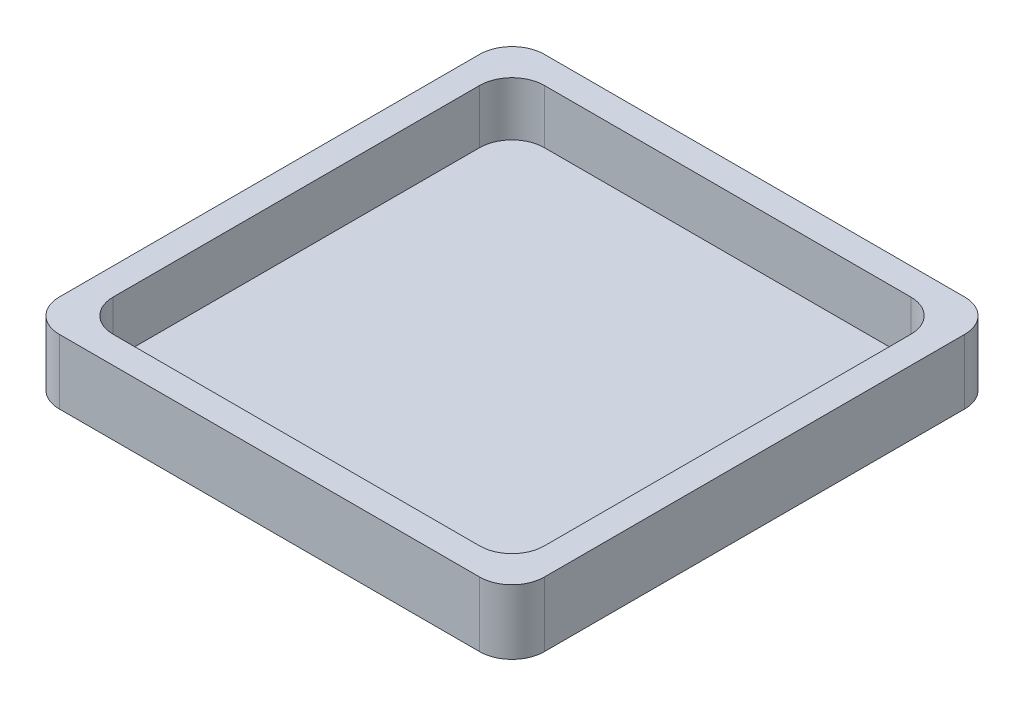
ISO-10303-21;
HEADER;
FILE_DESCRIPTION(('STEP AP214'),'2;1');
FILE_NAME('part.step','',(''),(''),'','','');
FILE_SCHEMA(('AUTOMOTIVE_DESIGN { 1 0 10303 214 1 1 1 1 }'));
ENDSEC;
DATA;
#1=APPLICATION_CONTEXT('core data for automotive mechanical design processes');
#2=APPLICATION_PROTOCOL_DEFINITION('international standard','automotive_design',2000,#1);
#3=PRODUCT_CONTEXT('',#1,'mechanical');
#4=PRODUCT('Part','Part','',(#3));
#5=PRODUCT_RELATED_PRODUCT_CATEGORY('part','',(#4));
#6=PRODUCT_DEFINITION_FORMATION('','',#4);
#7=PRODUCT_DEFINITION_CONTEXT('part definition',#1,'design');
#8=PRODUCT_DEFINITION('design','',#6,#7);
#9=PRODUCT_DEFINITION_SHAPE('','',#8);
#10=(LENGTH_UNIT() NAMED_UNIT(*) SI_UNIT(.MILLI.,.METRE.));
#11=(NAMED_UNIT(*) PLANE_ANGLE_UNIT() SI_UNIT($,.RADIAN.));
#12=(NAMED_UNIT(*) SI_UNIT($,.STERADIAN.) SOLID_ANGLE_UNIT());
#13=UNCERTAINTY_MEASURE_WITH_UNIT(LENGTH_MEASURE(1.E-05),#10,'distance_accuracy_value','');
#14=(GEOMETRIC_REPRESENTATION_CONTEXT(3) GLOBAL_UNCERTAINTY_ASSIGNED_CONTEXT((#13)) GLOBAL_UNIT_ASSIGNED_CONTEXT((#10,
#11,#12)) REPRESENTATION_CONTEXT('',''));
#15=CARTESIAN_POINT('',(0.,0.,0.));
#16=DIRECTION('',(0.,0.,1.));
#17=DIRECTION('',(1.,0.,0.));
#18=AXIS2_PLACEMENT_3D('',#15,#16,#17);
#19=CARTESIAN_POINT('',(0.,1.,0.));
#20=DIRECTION('',(0.,1.,0.));
#21=DIRECTION('',(0.,0.,1.));
#22=AXIS2_PLACEMENT_3D('',#19,#20,#21);
#23=PLANE('',#22);
#24=DIRECTION('',(0.,0.,-1.));
#25=VECTOR('',#24,1.);
#26=CARTESIAN_POINT('',(-20.,1.,20.));
#27=LINE('',#26,#25);
#28=CARTESIAN_POINT('',(-20.,1.,17.));
#29=VERTEX_POINT('',#28);
#30=CARTESIAN_POINT('',(-20.,1.,-17.));
#31=VERTEX_POINT('',#30);
#32=EDGE_CURVE('E203',#29,#31,#27,.T.);
#33=ORIENTED_EDGE('',*,*,#32,.F.);
#34=CARTESIAN_POINT('',(-17.,1.,17.));
#35=DIRECTION('',(0.,1.,0.));
#36=DIRECTION('',(0.,0.,1.));
#37=AXIS2_PLACEMENT_3D('',#34,#35,#36);
#38=CIRCLE('',#37,3.);
#39=CARTESIAN_POINT('',(-17.,1.,20.));
#40=VERTEX_POINT('',#39);
#41=EDGE_CURVE('E231',#29,#40,#38,.T.);
#42=ORIENTED_EDGE('',*,*,#41,.T.);
#43=DIRECTION('',(1.,0.,0.));
#44=VECTOR('',#43,1.);
#45=CARTESIAN_POINT('',(-20.,1.,20.));
#46=LINE('',#45,#44);
#47=CARTESIAN_POINT('',(17.,1.,20.));
#48=VERTEX_POINT('',#47);
#49=EDGE_CURVE('E201',#40,#48,#46,.T.);
#50=ORIENTED_EDGE('',*,*,#49,.T.);
#51=CARTESIAN_POINT('',(17.,1.,17.));
#52=DIRECTION('',(0.,1.,0.));
#53=DIRECTION('',(0.,0.,1.));
#54=AXIS2_PLACEMENT_3D('',#51,#52,#53);
#55=CIRCLE('',#54,3.);
#56=CARTESIAN_POINT('',(20.,1.,17.));
#57=VERTEX_POINT('',#56);
#58=EDGE_CURVE('E62',#48,#57,#55,.T.);
#59=ORIENTED_EDGE('',*,*,#58,.T.);
#60=DIRECTION('',(0.,0.,-1.));
#61=VECTOR('',#60,1.);
#62=CARTESIAN_POINT('',(20.,1.,20.));
#63=LINE('',#62,#61);
#64=CARTESIAN_POINT('',(20.,1.,-17.));
#65=VERTEX_POINT('',#64);
#66=EDGE_CURVE('E199',#57,#65,#63,.T.);
#67=ORIENTED_EDGE('',*,*,#66,.T.);
#68=CARTESIAN_POINT('',(17.,1.,-17.));
#69=DIRECTION('',(0.,1.,0.));
#70=DIRECTION('',(0.,0.,1.));
#71=AXIS2_PLACEMENT_3D('',#68,#69,#70);
#72=CIRCLE('',#71,3.);
#73=CARTESIAN_POINT('',(17.,1.,-20.));
#74=VERTEX_POINT('',#73);
#75=EDGE_CURVE('E54',#65,#74,#72,.T.);
#76=ORIENTED_EDGE('',*,*,#75,.T.);
#77=DIRECTION('',(1.,0.,0.));
#78=VECTOR('',#77,1.);
#79=CARTESIAN_POINT('',(-20.,1.,-20.));
#80=LINE('',#79,#78);
#81=CARTESIAN_POINT('',(-17.,1.,-20.));
#82=VERTEX_POINT('',#81);
#83=EDGE_CURVE('E196',#82,#74,#80,.T.);
#84=ORIENTED_EDGE('',*,*,#83,.F.);
#85=CARTESIAN_POINT('',(-17.,1.,-17.));
#86=DIRECTION('',(0.,1.,0.));
#87=DIRECTION('',(0.,0.,1.));
#88=AXIS2_PLACEMENT_3D('',#85,#86,#87);
#89=CIRCLE('',#88,3.);
#90=EDGE_CURVE('E227',#82,#31,#89,.T.);
#91=ORIENTED_EDGE('',*,*,#90,.T.);
#92=EDGE_LOOP('',(#33,#42,#50,#59,#67,#76,#84,#91));
#93=FACE_BOUND('',#92,.T.);
#94=ADVANCED_FACE('F39',(#93),#23,.T.);
#95=CARTESIAN_POINT('',(0.,6.,0.));
#96=DIRECTION('',(0.,-1.,0.));
#97=DIRECTION('',(0.,0.,-1.));
#98=AXIS2_PLACEMENT_3D('',#95,#96,#97);
#99=PLANE('',#98);
#100=DIRECTION('',(1.,0.,0.));
#101=VECTOR('',#100,1.);
#102=CARTESIAN_POINT('',(-22.5,6.,22.5));
#103=LINE('',#102,#101);
#104=CARTESIAN_POINT('',(-19.5,6.,22.5));
#105=VERTEX_POINT('',#104);
#106=CARTESIAN_POINT('',(19.5,6.,22.5));
#107=VERTEX_POINT('',#106);
#108=EDGE_CURVE('E189',#105,#107,#103,.T.);
#109=ORIENTED_EDGE('',*,*,#108,.T.);
#110=CARTESIAN_POINT('',(19.5,6.,19.5));
#111=DIRECTION('',(0.,-1.,0.));
#112=DIRECTION('',(0.,0.,-1.));
#113=AXIS2_PLACEMENT_3D('',#110,#111,#112);
#114=CIRCLE('',#113,3.);
#115=CARTESIAN_POINT('',(22.5,6.,19.5));
#116=VERTEX_POINT('',#115);
#117=EDGE_CURVE('E220',#107,#116,#114,.F.);
#118=ORIENTED_EDGE('',*,*,#117,.T.);
#119=DIRECTION('',(0.,0.,-1.));
#120=VECTOR('',#119,1.);
#121=CARTESIAN_POINT('',(22.5,6.,22.5));
#122=LINE('',#121,#120);
#123=CARTESIAN_POINT('',(22.5,6.,-19.5));
#124=VERTEX_POINT('',#123);
#125=EDGE_CURVE('E173',#116,#124,#122,.T.);
#126=ORIENTED_EDGE('',*,*,#125,.T.);
#127=CARTESIAN_POINT('',(19.5,6.,-19.5));
#128=DIRECTION('',(0.,-1.,0.));
#129=DIRECTION('',(0.,0.,-1.));
#130=AXIS2_PLACEMENT_3D('',#127,#128,#129);
#131=CIRCLE('',#130,3.);
#132=CARTESIAN_POINT('',(19.5,6.,-22.5));
#133=VERTEX_POINT('',#132);
#134=EDGE_CURVE('E214',#124,#133,#131,.F.);
#135=ORIENTED_EDGE('',*,*,#134,.T.);
#136=DIRECTION('',(-1.,0.,0.));
#137=VECTOR('',#136,1.);
#138=CARTESIAN_POINT('',(-22.5,6.,-22.5));
#139=LINE('',#138,#137);
#140=CARTESIAN_POINT('',(-19.5,6.,-22.5));
#141=VERTEX_POINT('',#140);
#142=EDGE_CURVE('E323',#133,#141,#139,.T.);
#143=ORIENTED_EDGE('',*,*,#142,.T.);
#144=CARTESIAN_POINT('',(-19.5,6.,-19.5));
#145=DIRECTION('',(0.,-1.,0.));
#146=DIRECTION('',(0.,0.,-1.));
#147=AXIS2_PLACEMENT_3D('',#144,#145,#146);
#148=CIRCLE('',#147,3.);
#149=CARTESIAN_POINT('',(-22.5,6.,-19.5));
#150=VERTEX_POINT('',#149);
#151=EDGE_CURVE('E216',#141,#150,#148,.F.);
#152=ORIENTED_EDGE('',*,*,#151,.T.);
#153=DIRECTION('',(0.,0.,1.));
#154=VECTOR('',#153,1.);
#155=CARTESIAN_POINT('',(-22.5,6.,22.5));
#156=LINE('',#155,#154);
#157=CARTESIAN_POINT('',(-22.5,6.,19.5));
#158=VERTEX_POINT('',#157);
#159=EDGE_CURVE('E325',#150,#158,#156,.T.);
#160=ORIENTED_EDGE('',*,*,#159,.T.);
#161=CARTESIAN_POINT('',(-19.5,6.,19.5));
#162=DIRECTION('',(0.,-1.,0.));
#163=DIRECTION('',(0.,0.,-1.));
#164=AXIS2_PLACEMENT_3D('',#161,#162,#163);
#165=CIRCLE('',#164,3.);
#166=EDGE_CURVE('E218',#158,#105,#165,.F.);
#167=ORIENTED_EDGE('',*,*,#166,.T.);
#168=EDGE_LOOP('',(#109,#118,#126,#135,#143,#152,#160,#167));
#169=FACE_BOUND('',#168,.T.);
#170=DIRECTION('',(0.,0.,-1.));
#171=VECTOR('',#170,1.);
#172=CARTESIAN_POINT('',(20.,6.,20.));
#173=LINE('',#172,#171);
#174=CARTESIAN_POINT('',(20.,6.,17.));
#175=VERTEX_POINT('',#174);
#176=CARTESIAN_POINT('',(20.,6.,-17.));
#177=VERTEX_POINT('',#176);
#178=EDGE_CURVE('E266',#175,#177,#173,.T.);
#179=ORIENTED_EDGE('',*,*,#178,.F.);
#180=CARTESIAN_POINT('',(17.,6.,17.));
#181=DIRECTION('',(0.,-1.,0.));
#182=DIRECTION('',(0.,0.,-1.));
#183=AXIS2_PLACEMENT_3D('',#180,#181,#182);
#184=CIRCLE('',#183,3.);
#185=CARTESIAN_POINT('',(17.,6.,20.));
#186=VERTEX_POINT('',#185);
#187=EDGE_CURVE('E259',#175,#186,#184,.T.);
#188=ORIENTED_EDGE('',*,*,#187,.T.);
#189=DIRECTION('',(1.,0.,0.));
#190=VECTOR('',#189,1.);
#191=CARTESIAN_POINT('',(-20.,6.,20.));
#192=LINE('',#191,#190);
#193=CARTESIAN_POINT('',(-17.,6.,20.));
#194=VERTEX_POINT('',#193);
#195=EDGE_CURVE('E180',#194,#186,#192,.T.);
#196=ORIENTED_EDGE('',*,*,#195,.F.);
#197=CARTESIAN_POINT('',(-17.,6.,17.));
#198=DIRECTION('',(0.,-1.,0.));
#199=DIRECTION('',(0.,0.,-1.));
#200=AXIS2_PLACEMENT_3D('',#197,#198,#199);
#201=CIRCLE('',#200,3.);
#202=CARTESIAN_POINT('',(-20.,6.,17.));
#203=VERTEX_POINT('',#202);
#204=EDGE_CURVE('E257',#194,#203,#201,.T.);
#205=ORIENTED_EDGE('',*,*,#204,.T.);
#206=DIRECTION('',(0.,0.,1.));
#207=VECTOR('',#206,1.);
#208=CARTESIAN_POINT('',(-20.,6.,20.));
#209=LINE('',#208,#207);
#210=CARTESIAN_POINT('',(-20.,6.,-17.));
#211=VERTEX_POINT('',#210);
#212=EDGE_CURVE('E186',#211,#203,#209,.T.);
#213=ORIENTED_EDGE('',*,*,#212,.F.);
#214=CARTESIAN_POINT('',(-17.,6.,-17.));
#215=DIRECTION('',(0.,-1.,0.));
#216=DIRECTION('',(0.,0.,-1.));
#217=AXIS2_PLACEMENT_3D('',#214,#215,#216);
#218=CIRCLE('',#217,3.);
#219=CARTESIAN_POINT('',(-17.,6.,-20.));
#220=VERTEX_POINT('',#219);
#221=EDGE_CURVE('E11',#211,#220,#218,.T.);
#222=ORIENTED_EDGE('',*,*,#221,.T.);
#223=DIRECTION('',(-1.,0.,0.));
#224=VECTOR('',#223,1.);
#225=CARTESIAN_POINT('',(-20.,6.,-20.));
#226=LINE('',#225,#224);
#227=CARTESIAN_POINT('',(17.,6.,-20.));
#228=VERTEX_POINT('',#227);
#229=EDGE_CURVE('E269',#228,#220,#226,.T.);
#230=ORIENTED_EDGE('',*,*,#229,.F.);
#231=CARTESIAN_POINT('',(17.,6.,-17.));
#232=DIRECTION('',(0.,-1.,0.));
#233=DIRECTION('',(0.,0.,-1.));
#234=AXIS2_PLACEMENT_3D('',#231,#232,#233);
#235=CIRCLE('',#234,3.);
#236=EDGE_CURVE('E47',#228,#177,#235,.T.);
#237=ORIENTED_EDGE('',*,*,#236,.T.);
#238=EDGE_LOOP('',(#179,#188,#196,#205,#213,#222,#230,#237));
#239=FACE_BOUND('',#238,.T.);
#240=ADVANCED_FACE('F265',(#169,#239),#99,.F.);
#241=CARTESIAN_POINT('',(22.5,6.,22.5));
#242=DIRECTION('',(-1.,0.,0.));
#243=DIRECTION('',(0.,0.,1.));
#244=AXIS2_PLACEMENT_3D('',#241,#242,#243);
#245=PLANE('',#244);
#246=ORIENTED_EDGE('',*,*,#125,.F.);
#247=DIRECTION('',(0.,-1.,0.));
#248=VECTOR('',#247,1.);
#249=CARTESIAN_POINT('',(22.5,6.,19.5));
#250=LINE('',#249,#248);
#251=CARTESIAN_POINT('',(22.5,0.,19.5));
#252=VERTEX_POINT('',#251);
#253=EDGE_CURVE('E157',#116,#252,#250,.T.);
#254=ORIENTED_EDGE('',*,*,#253,.T.);
#255=DIRECTION('',(0.,0.,-1.));
#256=VECTOR('',#255,1.);
#257=CARTESIAN_POINT('',(22.5,0.,22.5));
#258=LINE('',#257,#256);
#259=CARTESIAN_POINT('',(22.5,0.,-19.5));
#260=VERTEX_POINT('',#259);
#261=EDGE_CURVE('E170',#252,#260,#258,.T.);
#262=ORIENTED_EDGE('',*,*,#261,.T.);
#263=DIRECTION('',(0.,-1.,0.));
#264=VECTOR('',#263,1.);
#265=CARTESIAN_POINT('',(22.5,6.,-19.5));
#266=LINE('',#265,#264);
#267=EDGE_CURVE('E175',#260,#124,#266,.F.);
#268=ORIENTED_EDGE('',*,*,#267,.T.);
#269=EDGE_LOOP('',(#246,#254,#262,#268));
#270=FACE_BOUND('',#269,.T.);
#271=ADVANCED_FACE('F169',(#270),#245,.F.);
#272=CARTESIAN_POINT('',(-22.5,6.,-22.5));
#273=DIRECTION('',(0.,0.,1.));
#274=DIRECTION('',(1.,0.,0.));
#275=AXIS2_PLACEMENT_3D('',#272,#273,#274);
#276=PLANE('',#275);
#277=DIRECTION('',(-1.,0.,0.));
#278=VECTOR('',#277,1.);
#279=CARTESIAN_POINT('',(-22.5,0.,-22.5));
#280=LINE('',#279,#278);
#281=CARTESIAN_POINT('',(19.5,0.,-22.5));
#282=VERTEX_POINT('',#281);
#283=CARTESIAN_POINT('',(-19.5,0.,-22.5));
#284=VERTEX_POINT('',#283);
#285=EDGE_CURVE('E179',#282,#284,#280,.T.);
#286=ORIENTED_EDGE('',*,*,#285,.T.);
#287=DIRECTION('',(0.,-1.,0.));
#288=VECTOR('',#287,1.);
#289=CARTESIAN_POINT('',(-19.5,6.,-22.5));
#290=LINE('',#289,#288);
#291=EDGE_CURVE('E255',#284,#141,#290,.F.);
#292=ORIENTED_EDGE('',*,*,#291,.T.);
#293=ORIENTED_EDGE('',*,*,#142,.F.);
#294=DIRECTION('',(0.,-1.,0.));
#295=VECTOR('',#294,1.);
#296=CARTESIAN_POINT('',(19.5,6.,-22.5));
#297=LINE('',#296,#295);
#298=EDGE_CURVE('E252',#133,#282,#297,.T.);
#299=ORIENTED_EDGE('',*,*,#298,.T.);
#300=EDGE_LOOP('',(#286,#292,#293,#299));
#301=FACE_BOUND('',#300,.T.);
#302=ADVANCED_FACE('F345',(#301),#276,.F.);
#303=CARTESIAN_POINT('',(-22.5,6.,22.5));
#304=DIRECTION('',(1.,0.,0.));
#305=DIRECTION('',(0.,0.,-1.));
#306=AXIS2_PLACEMENT_3D('',#303,#304,#305);
#307=PLANE('',#306);
#308=DIRECTION('',(0.,0.,1.));
#309=VECTOR('',#308,1.);
#310=CARTESIAN_POINT('',(-22.5,0.,22.5));
#311=LINE('',#310,#309);
#312=CARTESIAN_POINT('',(-22.5,0.,-19.5));
#313=VERTEX_POINT('',#312);
#314=CARTESIAN_POINT('',(-22.5,0.,19.5));
#315=VERTEX_POINT('',#314);
#316=EDGE_CURVE('E183',#313,#315,#311,.T.);
#317=ORIENTED_EDGE('',*,*,#316,.T.);
#318=DIRECTION('',(0.,-1.,0.));
#319=VECTOR('',#318,1.);
#320=CARTESIAN_POINT('',(-22.5,6.,19.5));
#321=LINE('',#320,#319);
#322=EDGE_CURVE('E250',#315,#158,#321,.F.);
#323=ORIENTED_EDGE('',*,*,#322,.T.);
#324=ORIENTED_EDGE('',*,*,#159,.F.);
#325=DIRECTION('',(0.,-1.,0.));
#326=VECTOR('',#325,1.);
#327=CARTESIAN_POINT('',(-22.5,6.,-19.5));
#328=LINE('',#327,#326);
#329=EDGE_CURVE('E247',#150,#313,#328,.T.);
#330=ORIENTED_EDGE('',*,*,#329,.T.);
#331=EDGE_LOOP('',(#317,#323,#324,#330));
#332=FACE_BOUND('',#331,.T.);
#333=ADVANCED_FACE('F338',(#332),#307,.F.);
#334=CARTESIAN_POINT('',(-22.5,6.,22.5));
#335=DIRECTION('',(0.,0.,-1.));
#336=DIRECTION('',(-1.,0.,0.));
#337=AXIS2_PLACEMENT_3D('',#334,#335,#336);
#338=PLANE('',#337);
#339=DIRECTION('',(1.,0.,0.));
#340=VECTOR('',#339,1.);
#341=CARTESIAN_POINT('',(-22.5,0.,22.5));
#342=LINE('',#341,#340);
#343=CARTESIAN_POINT('',(-19.5,0.,22.5));
#344=VERTEX_POINT('',#343);
#345=CARTESIAN_POINT('',(19.5,0.,22.5));
#346=VERTEX_POINT('',#345);
#347=EDGE_CURVE('E194',#344,#346,#342,.T.);
#348=ORIENTED_EDGE('',*,*,#347,.T.);
#349=DIRECTION('',(0.,-1.,0.));
#350=VECTOR('',#349,1.);
#351=CARTESIAN_POINT('',(19.5,6.,22.5));
#352=LINE('',#351,#350);
#353=EDGE_CURVE('E158',#346,#107,#352,.F.);
#354=ORIENTED_EDGE('',*,*,#353,.T.);
#355=ORIENTED_EDGE('',*,*,#108,.F.);
#356=DIRECTION('',(0.,-1.,0.));
#357=VECTOR('',#356,1.);
#358=CARTESIAN_POINT('',(-19.5,6.,22.5));
#359=LINE('',#358,#357);
#360=EDGE_CURVE('E163',#105,#344,#359,.T.);
#361=ORIENTED_EDGE('',*,*,#360,.T.);
#362=EDGE_LOOP('',(#348,#354,#355,#361));
#363=FACE_BOUND('',#362,.T.);
#364=ADVANCED_FACE('F333',(#363),#338,.F.);
#365=CARTESIAN_POINT('',(20.,6.,20.));
#366=DIRECTION('',(-1.,0.,0.));
#367=DIRECTION('',(0.,0.,1.));
#368=AXIS2_PLACEMENT_3D('',#365,#366,#367);
#369=PLANE('',#368);
#370=ORIENTED_EDGE('',*,*,#66,.F.);
#371=DIRECTION('',(0.,-1.,0.));
#372=VECTOR('',#371,1.);
#373=CARTESIAN_POINT('',(20.,6.,17.));
#374=LINE('',#373,#372);
#375=EDGE_CURVE('E240',#57,#175,#374,.F.);
#376=ORIENTED_EDGE('',*,*,#375,.T.);
#377=ORIENTED_EDGE('',*,*,#178,.T.);
#378=DIRECTION('',(0.,-1.,0.));
#379=VECTOR('',#378,1.);
#380=CARTESIAN_POINT('',(20.,1.,-17.));
#381=LINE('',#380,#379);
#382=EDGE_CURVE('E238',#177,#65,#381,.T.);
#383=ORIENTED_EDGE('',*,*,#382,.T.);
#384=EDGE_LOOP('',(#370,#376,#377,#383));
#385=FACE_BOUND('',#384,.T.);
#386=ADVANCED_FACE('F271',(#385),#369,.T.);
#387=CARTESIAN_POINT('',(-20.,6.,-20.));
#388=DIRECTION('',(0.,0.,1.));
#389=DIRECTION('',(1.,0.,0.));
#390=AXIS2_PLACEMENT_3D('',#387,#388,#389);
#391=PLANE('',#390);
#392=ORIENTED_EDGE('',*,*,#83,.T.);
#393=DIRECTION('',(0.,-1.,0.));
#394=VECTOR('',#393,1.);
#395=CARTESIAN_POINT('',(17.,6.,-20.));
#396=LINE('',#395,#394);
#397=EDGE_CURVE('E245',#74,#228,#396,.F.);
#398=ORIENTED_EDGE('',*,*,#397,.T.);
#399=ORIENTED_EDGE('',*,*,#229,.T.);
#400=DIRECTION('',(0.,-1.,0.));
#401=VECTOR('',#400,1.);
#402=CARTESIAN_POINT('',(-17.,1.,-20.));
#403=LINE('',#402,#401);
#404=EDGE_CURVE('E242',#220,#82,#403,.T.);
#405=ORIENTED_EDGE('',*,*,#404,.T.);
#406=EDGE_LOOP('',(#392,#398,#399,#405));
#407=FACE_BOUND('',#406,.T.);
#408=ADVANCED_FACE('F413',(#407),#391,.T.);
#409=CARTESIAN_POINT('',(-20.,6.,20.));
#410=DIRECTION('',(1.,0.,0.));
#411=DIRECTION('',(0.,0.,-1.));
#412=AXIS2_PLACEMENT_3D('',#409,#410,#411);
#413=PLANE('',#412);
#414=ORIENTED_EDGE('',*,*,#212,.T.);
#415=DIRECTION('',(0.,-1.,0.));
#416=VECTOR('',#415,1.);
#417=CARTESIAN_POINT('',(-20.,1.,17.));
#418=LINE('',#417,#416);
#419=EDGE_CURVE('E224',#203,#29,#418,.T.);
#420=ORIENTED_EDGE('',*,*,#419,.T.);
#421=ORIENTED_EDGE('',*,*,#32,.T.);
#422=DIRECTION('',(0.,-1.,0.));
#423=VECTOR('',#422,1.);
#424=CARTESIAN_POINT('',(-20.,6.,-17.));
#425=LINE('',#424,#423);
#426=EDGE_CURVE('E222',#31,#211,#425,.F.);
#427=ORIENTED_EDGE('',*,*,#426,.T.);
#428=EDGE_LOOP('',(#414,#420,#421,#427));
#429=FACE_BOUND('',#428,.T.);
#430=ADVANCED_FACE('F317',(#429),#413,.T.);
#431=CARTESIAN_POINT('',(-20.,6.,20.));
#432=DIRECTION('',(0.,0.,-1.));
#433=DIRECTION('',(-1.,0.,0.));
#434=AXIS2_PLACEMENT_3D('',#431,#432,#433);
#435=PLANE('',#434);
#436=ORIENTED_EDGE('',*,*,#49,.F.);
#437=DIRECTION('',(0.,-1.,0.));
#438=VECTOR('',#437,1.);
#439=CARTESIAN_POINT('',(-17.,6.,20.));
#440=LINE('',#439,#438);
#441=EDGE_CURVE('E236',#40,#194,#440,.F.);
#442=ORIENTED_EDGE('',*,*,#441,.T.);
#443=ORIENTED_EDGE('',*,*,#195,.T.);
#444=DIRECTION('',(0.,-1.,0.));
#445=VECTOR('',#444,1.);
#446=CARTESIAN_POINT('',(17.,1.,20.));
#447=LINE('',#446,#445);
#448=EDGE_CURVE('E233',#186,#48,#447,.T.);
#449=ORIENTED_EDGE('',*,*,#448,.T.);
#450=EDGE_LOOP('',(#436,#442,#443,#449));
#451=FACE_BOUND('',#450,.T.);
#452=ADVANCED_FACE('F302',(#451),#435,.T.);
#453=CARTESIAN_POINT('',(0.,0.,0.));
#454=DIRECTION('',(0.,1.,0.));
#455=DIRECTION('',(0.,0.,1.));
#456=AXIS2_PLACEMENT_3D('',#453,#454,#455);
#457=PLANE('',#456);
#458=ORIENTED_EDGE('',*,*,#261,.F.);
#459=CARTESIAN_POINT('',(19.5,0.,19.5));
#460=DIRECTION('',(0.,1.,0.));
#461=DIRECTION('',(0.,0.,1.));
#462=AXIS2_PLACEMENT_3D('',#459,#460,#461);
#463=CIRCLE('',#462,3.);
#464=EDGE_CURVE('E153',#252,#346,#463,.F.);
#465=ORIENTED_EDGE('',*,*,#464,.T.);
#466=ORIENTED_EDGE('',*,*,#347,.F.);
#467=CARTESIAN_POINT('',(-19.5,0.,19.5));
#468=DIRECTION('',(0.,1.,0.));
#469=DIRECTION('',(0.,0.,1.));
#470=AXIS2_PLACEMENT_3D('',#467,#468,#469);
#471=CIRCLE('',#470,3.);
#472=EDGE_CURVE('E164',#344,#315,#471,.F.);
#473=ORIENTED_EDGE('',*,*,#472,.T.);
#474=ORIENTED_EDGE('',*,*,#316,.F.);
#475=CARTESIAN_POINT('',(-19.5,0.,-19.5));
#476=DIRECTION('',(0.,1.,0.));
#477=DIRECTION('',(0.,0.,1.));
#478=AXIS2_PLACEMENT_3D('',#475,#476,#477);
#479=CIRCLE('',#478,3.);
#480=EDGE_CURVE('E208',#313,#284,#479,.F.);
#481=ORIENTED_EDGE('',*,*,#480,.T.);
#482=ORIENTED_EDGE('',*,*,#285,.F.);
#483=CARTESIAN_POINT('',(19.5,0.,-19.5));
#484=DIRECTION('',(0.,1.,0.));
#485=DIRECTION('',(0.,0.,1.));
#486=AXIS2_PLACEMENT_3D('',#483,#484,#485);
#487=CIRCLE('',#486,3.);
#488=EDGE_CURVE('E174',#282,#260,#487,.F.);
#489=ORIENTED_EDGE('',*,*,#488,.T.);
#490=EDGE_LOOP('',(#458,#465,#466,#473,#474,#481,#482,#489));
#491=FACE_BOUND('',#490,.T.);
#492=ADVANCED_FACE('F177',(#491),#457,.F.);
#493=CARTESIAN_POINT('',(19.5,6.,19.5));
#494=DIRECTION('',(0.,-1.,0.));
#495=DIRECTION('',(0.,0.,-1.));
#496=AXIS2_PLACEMENT_3D('',#493,#494,#495);
#497=CYLINDRICAL_SURFACE('',#496,3.);
#498=ORIENTED_EDGE('',*,*,#117,.F.);
#499=ORIENTED_EDGE('',*,*,#353,.F.);
#500=ORIENTED_EDGE('',*,*,#464,.F.);
#501=ORIENTED_EDGE('',*,*,#253,.F.);
#502=EDGE_LOOP('',(#498,#499,#500,#501));
#503=FACE_BOUND('',#502,.T.);
#504=ADVANCED_FACE('F156',(#503),#497,.T.);
#505=CARTESIAN_POINT('',(-17.,6.,17.));
#506=DIRECTION('',(0.,1.,0.));
#507=DIRECTION('',(0.,0.,1.));
#508=AXIS2_PLACEMENT_3D('',#505,#506,#507);
#509=CYLINDRICAL_SURFACE('',#508,3.);
#510=ORIENTED_EDGE('',*,*,#204,.F.);
#511=ORIENTED_EDGE('',*,*,#441,.F.);
#512=ORIENTED_EDGE('',*,*,#41,.F.);
#513=ORIENTED_EDGE('',*,*,#419,.F.);
#514=EDGE_LOOP('',(#510,#511,#512,#513));
#515=FACE_BOUND('',#514,.T.);
#516=ADVANCED_FACE('F286',(#515),#509,.F.);
#517=CARTESIAN_POINT('',(17.,6.,17.));
#518=DIRECTION('',(0.,1.,0.));
#519=DIRECTION('',(0.,0.,1.));
#520=AXIS2_PLACEMENT_3D('',#517,#518,#519);
#521=CYLINDRICAL_SURFACE('',#520,3.);
#522=ORIENTED_EDGE('',*,*,#187,.F.);
#523=ORIENTED_EDGE('',*,*,#375,.F.);
#524=ORIENTED_EDGE('',*,*,#58,.F.);
#525=ORIENTED_EDGE('',*,*,#448,.F.);
#526=EDGE_LOOP('',(#522,#523,#524,#525));
#527=FACE_BOUND('',#526,.T.);
#528=ADVANCED_FACE('F277',(#527),#521,.F.);
#529=CARTESIAN_POINT('',(17.,6.,-17.));
#530=DIRECTION('',(0.,1.,0.));
#531=DIRECTION('',(0.,0.,1.));
#532=AXIS2_PLACEMENT_3D('',#529,#530,#531);
#533=CYLINDRICAL_SURFACE('',#532,3.);
#534=ORIENTED_EDGE('',*,*,#236,.F.);
#535=ORIENTED_EDGE('',*,*,#397,.F.);
#536=ORIENTED_EDGE('',*,*,#75,.F.);
#537=ORIENTED_EDGE('',*,*,#382,.F.);
#538=EDGE_LOOP('',(#534,#535,#536,#537));
#539=FACE_BOUND('',#538,.T.);
#540=ADVANCED_FACE('F274',(#539),#533,.F.);
#541=CARTESIAN_POINT('',(-17.,6.,-17.));
#542=DIRECTION('',(0.,1.,0.));
#543=DIRECTION('',(0.,0.,1.));
#544=AXIS2_PLACEMENT_3D('',#541,#542,#543);
#545=CYLINDRICAL_SURFACE('',#544,3.);
#546=ORIENTED_EDGE('',*,*,#221,.F.);
#547=ORIENTED_EDGE('',*,*,#426,.F.);
#548=ORIENTED_EDGE('',*,*,#90,.F.);
#549=ORIENTED_EDGE('',*,*,#404,.F.);
#550=EDGE_LOOP('',(#546,#547,#548,#549));
#551=FACE_BOUND('',#550,.T.);
#552=ADVANCED_FACE('F276',(#551),#545,.F.);
#553=CARTESIAN_POINT('',(-19.5,6.,19.5));
#554=DIRECTION('',(0.,-1.,0.));
#555=DIRECTION('',(0.,0.,-1.));
#556=AXIS2_PLACEMENT_3D('',#553,#554,#555);
#557=CYLINDRICAL_SURFACE('',#556,3.);
#558=ORIENTED_EDGE('',*,*,#166,.F.);
#559=ORIENTED_EDGE('',*,*,#322,.F.);
#560=ORIENTED_EDGE('',*,*,#472,.F.);
#561=ORIENTED_EDGE('',*,*,#360,.F.);
#562=EDGE_LOOP('',(#558,#559,#560,#561));
#563=FACE_BOUND('',#562,.T.);
#564=ADVANCED_FACE('F283',(#563),#557,.T.);
#565=CARTESIAN_POINT('',(-19.5,6.,-19.5));
#566=DIRECTION('',(0.,-1.,0.));
#567=DIRECTION('',(0.,0.,-1.));
#568=AXIS2_PLACEMENT_3D('',#565,#566,#567);
#569=CYLINDRICAL_SURFACE('',#568,3.);
#570=ORIENTED_EDGE('',*,*,#151,.F.);
#571=ORIENTED_EDGE('',*,*,#291,.F.);
#572=ORIENTED_EDGE('',*,*,#480,.F.);
#573=ORIENTED_EDGE('',*,*,#329,.F.);
#574=EDGE_LOOP('',(#570,#571,#572,#573));
#575=FACE_BOUND('',#574,.T.);
#576=ADVANCED_FACE('F342',(#575),#569,.T.);
#577=CARTESIAN_POINT('',(19.5,6.,-19.5));
#578=DIRECTION('',(0.,-1.,0.));
#579=DIRECTION('',(0.,0.,-1.));
#580=AXIS2_PLACEMENT_3D('',#577,#578,#579);
#581=CYLINDRICAL_SURFACE('',#580,3.);
#582=ORIENTED_EDGE('',*,*,#134,.F.);
#583=ORIENTED_EDGE('',*,*,#267,.F.);
#584=ORIENTED_EDGE('',*,*,#488,.F.);
#585=ORIENTED_EDGE('',*,*,#298,.F.);
#586=EDGE_LOOP('',(#582,#583,#584,#585));
#587=FACE_BOUND('',#586,.T.);
#588=ADVANCED_FACE('F41',(#587),#581,.T.);
#589=CLOSED_SHELL('',(#94,#240,#271,#302,#333,#364,#386,#408,#430,#452,#492,#504,#516,#528,#540,
#552,#564,#576,#588));
#590=MANIFOLD_SOLID_BREP('B2',#589);
#591=ADVANCED_BREP_SHAPE_REPRESENTATION('',(#18,#590),#14);
#592=SHAPE_DEFINITION_REPRESENTATION(#9,#591);
ENDSEC;
END-ISO-10303-21;
